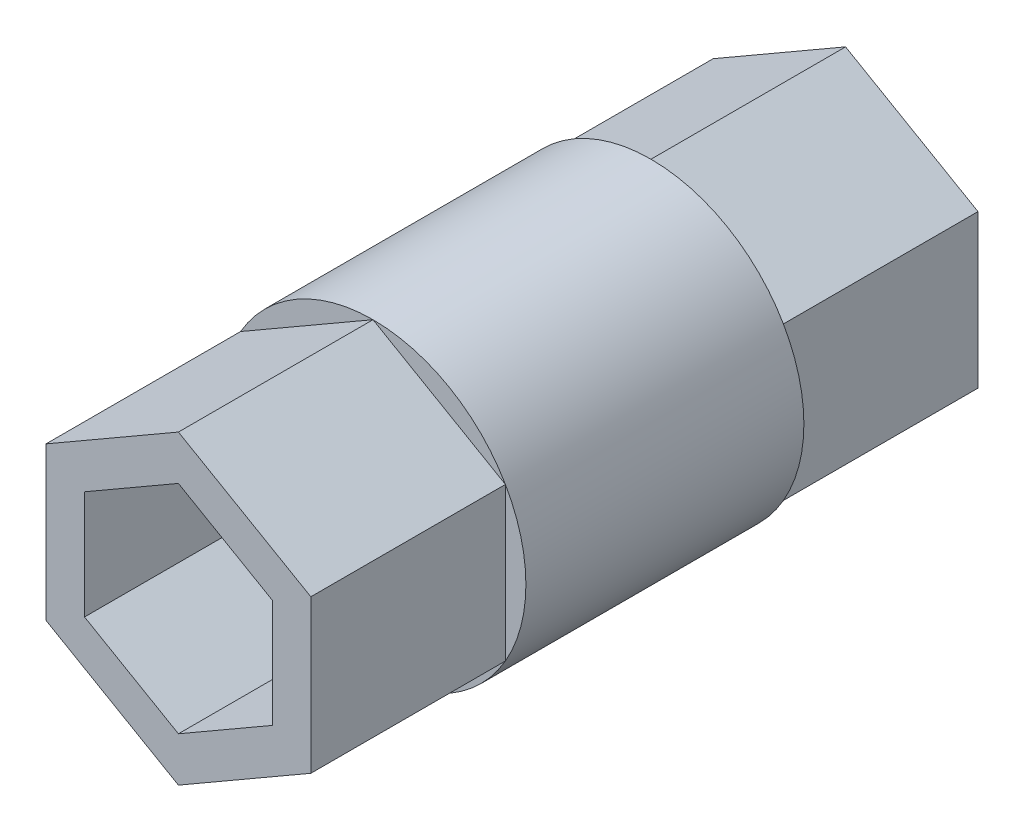
ISO-10303-21;
HEADER;
FILE_DESCRIPTION(('STEP AP214'),'2;1');
FILE_NAME('part.step','',(''),(''),'','','');
FILE_SCHEMA(('AUTOMOTIVE_DESIGN { 1 0 10303 214 1 1 1 1 }'));
ENDSEC;
DATA;
#1=APPLICATION_CONTEXT('core data for automotive mechanical design processes');
#2=APPLICATION_PROTOCOL_DEFINITION('international standard','automotive_design',2000,#1);
#3=PRODUCT_CONTEXT('',#1,'mechanical');
#4=PRODUCT('Part','Part','',(#3));
#5=PRODUCT_RELATED_PRODUCT_CATEGORY('part','',(#4));
#6=PRODUCT_DEFINITION_FORMATION('','',#4);
#7=PRODUCT_DEFINITION_CONTEXT('part definition',#1,'design');
#8=PRODUCT_DEFINITION('design','',#6,#7);
#9=PRODUCT_DEFINITION_SHAPE('','',#8);
#10=(LENGTH_UNIT() NAMED_UNIT(*) SI_UNIT(.MILLI.,.METRE.));
#11=(NAMED_UNIT(*) PLANE_ANGLE_UNIT() SI_UNIT($,.RADIAN.));
#12=(NAMED_UNIT(*) SI_UNIT($,.STERADIAN.) SOLID_ANGLE_UNIT());
#13=UNCERTAINTY_MEASURE_WITH_UNIT(LENGTH_MEASURE(1.E-05),#10,'distance_accuracy_value','');
#14=(GEOMETRIC_REPRESENTATION_CONTEXT(3) GLOBAL_UNCERTAINTY_ASSIGNED_CONTEXT((#13)) GLOBAL_UNIT_ASSIGNED_CONTEXT((#10,
#11,#12)) REPRESENTATION_CONTEXT('',''));
#15=CARTESIAN_POINT('',(0.,0.,0.));
#16=DIRECTION('',(0.,0.,1.));
#17=DIRECTION('',(1.,0.,0.));
#18=AXIS2_PLACEMENT_3D('',#15,#16,#17);
#19=CARTESIAN_POINT('',(0.,0.,10.));
#20=DIRECTION('',(0.,0.,1.));
#21=DIRECTION('',(1.,0.,0.));
#22=AXIS2_PLACEMENT_3D('',#19,#20,#21);
#23=PLANE('',#22);
#24=CARTESIAN_POINT('',(0.,0.,10.));
#25=DIRECTION('',(0.,0.,1.));
#26=DIRECTION('',(1.,0.,0.));
#27=AXIS2_PLACEMENT_3D('',#24,#25,#26);
#28=CIRCLE('',#27,11.);
#29=CARTESIAN_POINT('',(-9.52627944162882,-5.5,10.));
#30=VERTEX_POINT('',#29);
#31=CARTESIAN_POINT('',(0.,-11.,10.));
#32=VERTEX_POINT('',#31);
#33=EDGE_CURVE('E410',#30,#32,#28,.T.);
#34=ORIENTED_EDGE('',*,*,#33,.T.);
#35=DIRECTION('',(-0.866025403784439,0.5,0.));
#36=VECTOR('',#35,1.);
#37=CARTESIAN_POINT('',(-4.76313972081441,-8.25,10.));
#38=LINE('',#37,#36);
#39=EDGE_CURVE('E302',#32,#30,#38,.T.);
#40=ORIENTED_EDGE('',*,*,#39,.T.);
#41=EDGE_LOOP('',(#34,#40));
#42=FACE_BOUND('',#41,.T.);
#43=ADVANCED_FACE('F56',(#42),#23,.T.);
#44=CARTESIAN_POINT('',(9.52627944162883,-5.5,10.));
#45=VERTEX_POINT('',#44);
#46=EDGE_CURVE('E411',#32,#45,#28,.T.);
#47=ORIENTED_EDGE('',*,*,#46,.T.);
#48=DIRECTION('',(-0.866025403784439,-0.5,0.));
#49=VECTOR('',#48,1.);
#50=CARTESIAN_POINT('',(4.76313972081441,-8.25,10.));
#51=LINE('',#50,#49);
#52=EDGE_CURVE('E299',#45,#32,#51,.T.);
#53=ORIENTED_EDGE('',*,*,#52,.T.);
#54=EDGE_LOOP('',(#47,#53));
#55=FACE_BOUND('',#54,.T.);
#56=ADVANCED_FACE('F386',(#55),#23,.T.);
#57=CARTESIAN_POINT('',(9.52627944162882,5.5,10.));
#58=VERTEX_POINT('',#57);
#59=EDGE_CURVE('E311',#45,#58,#28,.T.);
#60=ORIENTED_EDGE('',*,*,#59,.T.);
#61=DIRECTION('',(0.,-1.,0.));
#62=VECTOR('',#61,1.);
#63=CARTESIAN_POINT('',(9.52627944162882,0.,10.));
#64=LINE('',#63,#62);
#65=EDGE_CURVE('E296',#58,#45,#64,.T.);
#66=ORIENTED_EDGE('',*,*,#65,.T.);
#67=EDGE_LOOP('',(#60,#66));
#68=FACE_BOUND('',#67,.T.);
#69=ADVANCED_FACE('F391',(#68),#23,.T.);
#70=CARTESIAN_POINT('',(0.,11.,10.));
#71=VERTEX_POINT('',#70);
#72=EDGE_CURVE('E306',#58,#71,#28,.T.);
#73=ORIENTED_EDGE('',*,*,#72,.T.);
#74=DIRECTION('',(0.866025403784439,-0.5,0.));
#75=VECTOR('',#74,1.);
#76=CARTESIAN_POINT('',(4.76313972081441,8.25,10.));
#77=LINE('',#76,#75);
#78=EDGE_CURVE('E293',#71,#58,#77,.T.);
#79=ORIENTED_EDGE('',*,*,#78,.T.);
#80=EDGE_LOOP('',(#73,#79));
#81=FACE_BOUND('',#80,.T.);
#82=ADVANCED_FACE('F401',(#81),#23,.T.);
#83=CARTESIAN_POINT('',(-9.52627944162882,5.5,10.));
#84=VERTEX_POINT('',#83);
#85=EDGE_CURVE('E310',#71,#84,#28,.T.);
#86=ORIENTED_EDGE('',*,*,#85,.T.);
#87=DIRECTION('',(0.866025403784439,0.5,0.));
#88=VECTOR('',#87,1.);
#89=CARTESIAN_POINT('',(-4.76313972081441,8.25,10.));
#90=LINE('',#89,#88);
#91=EDGE_CURVE('E290',#84,#71,#90,.T.);
#92=ORIENTED_EDGE('',*,*,#91,.T.);
#93=EDGE_LOOP('',(#86,#92));
#94=FACE_BOUND('',#93,.T.);
#95=ADVANCED_FACE('F396',(#94),#23,.T.);
#96=EDGE_CURVE('E405',#84,#30,#28,.T.);
#97=ORIENTED_EDGE('',*,*,#96,.T.);
#98=DIRECTION('',(0.,1.,0.));
#99=VECTOR('',#98,1.);
#100=CARTESIAN_POINT('',(-9.52627944162882,0.,10.));
#101=LINE('',#100,#99);
#102=EDGE_CURVE('E287',#30,#84,#101,.T.);
#103=ORIENTED_EDGE('',*,*,#102,.T.);
#104=EDGE_LOOP('',(#97,#103));
#105=FACE_BOUND('',#104,.T.);
#106=ADVANCED_FACE('F383',(#105),#23,.T.);
#107=CARTESIAN_POINT('',(0.,0.,-10.));
#108=DIRECTION('',(0.,0.,1.));
#109=DIRECTION('',(1.,0.,0.));
#110=AXIS2_PLACEMENT_3D('',#107,#108,#109);
#111=PLANE('',#110);
#112=DIRECTION('',(-0.866025403784439,0.5,0.));
#113=VECTOR('',#112,1.);
#114=CARTESIAN_POINT('',(-4.76313972081441,-8.25,-10.));
#115=LINE('',#114,#113);
#116=CARTESIAN_POINT('',(0.,-11.,-10.));
#117=VERTEX_POINT('',#116);
#118=CARTESIAN_POINT('',(-9.52627944162882,-5.50000000000001,-10.));
#119=VERTEX_POINT('',#118);
#120=EDGE_CURVE('E12',#117,#119,#115,.T.);
#121=ORIENTED_EDGE('',*,*,#120,.F.);
#122=CARTESIAN_POINT('',(0.,0.,-10.));
#123=DIRECTION('',(0.,0.,1.));
#124=DIRECTION('',(1.,0.,0.));
#125=AXIS2_PLACEMENT_3D('',#122,#123,#124);
#126=CIRCLE('',#125,11.);
#127=EDGE_CURVE('E375',#119,#117,#126,.T.);
#128=ORIENTED_EDGE('',*,*,#127,.F.);
#129=EDGE_LOOP('',(#121,#128));
#130=FACE_BOUND('',#129,.T.);
#131=ADVANCED_FACE('F376',(#130),#111,.F.);
#132=DIRECTION('',(-0.866025403784439,-0.5,0.));
#133=VECTOR('',#132,1.);
#134=CARTESIAN_POINT('',(4.76313972081441,-8.25,-10.));
#135=LINE('',#134,#133);
#136=CARTESIAN_POINT('',(9.52627944162883,-5.5,-10.));
#137=VERTEX_POINT('',#136);
#138=EDGE_CURVE('E64',#137,#117,#135,.T.);
#139=ORIENTED_EDGE('',*,*,#138,.F.);
#140=EDGE_CURVE('E353',#117,#137,#126,.T.);
#141=ORIENTED_EDGE('',*,*,#140,.F.);
#142=EDGE_LOOP('',(#139,#141));
#143=FACE_BOUND('',#142,.T.);
#144=ADVANCED_FACE('F377',(#143),#111,.F.);
#145=DIRECTION('',(0.,-1.,0.));
#146=VECTOR('',#145,1.);
#147=CARTESIAN_POINT('',(9.52627944162882,0.,-10.));
#148=LINE('',#147,#146);
#149=CARTESIAN_POINT('',(9.52627944162882,5.50000000000001,-10.));
#150=VERTEX_POINT('',#149);
#151=EDGE_CURVE('E324',#150,#137,#148,.T.);
#152=ORIENTED_EDGE('',*,*,#151,.F.);
#153=EDGE_CURVE('E305',#137,#150,#126,.T.);
#154=ORIENTED_EDGE('',*,*,#153,.F.);
#155=EDGE_LOOP('',(#152,#154));
#156=FACE_BOUND('',#155,.T.);
#157=ADVANCED_FACE('F348',(#156),#111,.F.);
#158=DIRECTION('',(0.866025403784439,-0.5,0.));
#159=VECTOR('',#158,1.);
#160=CARTESIAN_POINT('',(4.76313972081441,8.25,-10.));
#161=LINE('',#160,#159);
#162=CARTESIAN_POINT('',(0.,11.,-10.));
#163=VERTEX_POINT('',#162);
#164=EDGE_CURVE('E321',#163,#150,#161,.T.);
#165=ORIENTED_EDGE('',*,*,#164,.F.);
#166=EDGE_CURVE('E312',#150,#163,#126,.T.);
#167=ORIENTED_EDGE('',*,*,#166,.F.);
#168=EDGE_LOOP('',(#165,#167));
#169=FACE_BOUND('',#168,.T.);
#170=ADVANCED_FACE('F355',(#169),#111,.F.);
#171=DIRECTION('',(0.866025403784439,0.5,0.));
#172=VECTOR('',#171,1.);
#173=CARTESIAN_POINT('',(-4.76313972081441,8.25,-10.));
#174=LINE('',#173,#172);
#175=CARTESIAN_POINT('',(-9.52627944162882,5.5,-10.));
#176=VERTEX_POINT('',#175);
#177=EDGE_CURVE('E318',#176,#163,#174,.T.);
#178=ORIENTED_EDGE('',*,*,#177,.F.);
#179=EDGE_CURVE('E315',#163,#176,#126,.T.);
#180=ORIENTED_EDGE('',*,*,#179,.F.);
#181=EDGE_LOOP('',(#178,#180));
#182=FACE_BOUND('',#181,.T.);
#183=ADVANCED_FACE('F365',(#182),#111,.F.);
#184=DIRECTION('',(0.,1.,0.));
#185=VECTOR('',#184,1.);
#186=CARTESIAN_POINT('',(-9.52627944162882,0.,-10.));
#187=LINE('',#186,#185);
#188=EDGE_CURVE('E309',#119,#176,#187,.T.);
#189=ORIENTED_EDGE('',*,*,#188,.F.);
#190=EDGE_CURVE('E373',#176,#119,#126,.T.);
#191=ORIENTED_EDGE('',*,*,#190,.F.);
#192=EDGE_LOOP('',(#189,#191));
#193=FACE_BOUND('',#192,.T.);
#194=ADVANCED_FACE('F371',(#193),#111,.F.);
#195=CARTESIAN_POINT('',(0.,0.,10.));
#196=DIRECTION('',(0.,0.,-1.));
#197=DIRECTION('',(-1.,0.,0.));
#198=AXIS2_PLACEMENT_3D('',#195,#196,#197);
#199=CYLINDRICAL_SURFACE('',#198,11.);
#200=ORIENTED_EDGE('',*,*,#46,.F.);
#201=ORIENTED_EDGE('',*,*,#33,.F.);
#202=ORIENTED_EDGE('',*,*,#96,.F.);
#203=ORIENTED_EDGE('',*,*,#85,.F.);
#204=ORIENTED_EDGE('',*,*,#72,.F.);
#205=ORIENTED_EDGE('',*,*,#59,.F.);
#206=EDGE_LOOP('',(#200,#201,#202,#203,#204,#205));
#207=FACE_BOUND('',#206,.T.);
#208=ORIENTED_EDGE('',*,*,#127,.T.);
#209=ORIENTED_EDGE('',*,*,#140,.T.);
#210=ORIENTED_EDGE('',*,*,#153,.T.);
#211=ORIENTED_EDGE('',*,*,#166,.T.);
#212=ORIENTED_EDGE('',*,*,#179,.T.);
#213=ORIENTED_EDGE('',*,*,#190,.T.);
#214=EDGE_LOOP('',(#208,#209,#210,#211,#212,#213));
#215=FACE_BOUND('',#214,.T.);
#216=ADVANCED_FACE('F58',(#207,#215),#199,.T.);
#217=CARTESIAN_POINT('',(0.,0.,-24.));
#218=DIRECTION('',(0.,0.,1.));
#219=DIRECTION('',(1.,0.,0.));
#220=AXIS2_PLACEMENT_3D('',#217,#218,#219);
#221=PLANE('',#220);
#222=DIRECTION('',(0.,-1.,0.));
#223=VECTOR('',#222,1.);
#224=CARTESIAN_POINT('',(-6.75499814951862,3.9,-24.));
#225=LINE('',#224,#223);
#226=CARTESIAN_POINT('',(-6.75499814951862,3.9,-24.));
#227=VERTEX_POINT('',#226);
#228=CARTESIAN_POINT('',(-6.75499814951862,-3.9,-24.));
#229=VERTEX_POINT('',#228);
#230=EDGE_CURVE('E189',#227,#229,#225,.T.);
#231=ORIENTED_EDGE('',*,*,#230,.T.);
#232=DIRECTION('',(0.866025403784439,-0.5,0.));
#233=VECTOR('',#232,1.);
#234=CARTESIAN_POINT('',(-6.75499814951862,-3.9,-24.));
#235=LINE('',#234,#233);
#236=CARTESIAN_POINT('',(0.,-7.8,-24.));
#237=VERTEX_POINT('',#236);
#238=EDGE_CURVE('E183',#229,#237,#235,.T.);
#239=ORIENTED_EDGE('',*,*,#238,.T.);
#240=DIRECTION('',(0.866025403784439,0.5,0.));
#241=VECTOR('',#240,1.);
#242=CARTESIAN_POINT('',(0.,-7.8,-24.));
#243=LINE('',#242,#241);
#244=CARTESIAN_POINT('',(6.75499814951862,-3.9,-24.));
#245=VERTEX_POINT('',#244);
#246=EDGE_CURVE('E192',#237,#245,#243,.T.);
#247=ORIENTED_EDGE('',*,*,#246,.T.);
#248=DIRECTION('',(0.,1.,0.));
#249=VECTOR('',#248,1.);
#250=CARTESIAN_POINT('',(6.75499814951862,-3.9,-24.));
#251=LINE('',#250,#249);
#252=CARTESIAN_POINT('',(6.75499814951862,3.9,-24.));
#253=VERTEX_POINT('',#252);
#254=EDGE_CURVE('E71',#245,#253,#251,.T.);
#255=ORIENTED_EDGE('',*,*,#254,.T.);
#256=DIRECTION('',(-0.866025403784439,0.5,0.));
#257=VECTOR('',#256,1.);
#258=CARTESIAN_POINT('',(6.75499814951862,3.9,-24.));
#259=LINE('',#258,#257);
#260=CARTESIAN_POINT('',(0.,7.8,-24.));
#261=VERTEX_POINT('',#260);
#262=EDGE_CURVE('E207',#253,#261,#259,.T.);
#263=ORIENTED_EDGE('',*,*,#262,.T.);
#264=DIRECTION('',(-0.866025403784439,-0.5,0.));
#265=VECTOR('',#264,1.);
#266=CARTESIAN_POINT('',(0.,7.8,-24.));
#267=LINE('',#266,#265);
#268=EDGE_CURVE('E210',#261,#227,#267,.T.);
#269=ORIENTED_EDGE('',*,*,#268,.T.);
#270=EDGE_LOOP('',(#231,#239,#247,#255,#263,#269));
#271=FACE_BOUND('',#270,.T.);
#272=DIRECTION('',(0.,-1.,0.));
#273=VECTOR('',#272,1.);
#274=CARTESIAN_POINT('',(-9.52627944162882,0.,-24.));
#275=LINE('',#274,#273);
#276=CARTESIAN_POINT('',(-9.52627944162882,5.5,-24.));
#277=VERTEX_POINT('',#276);
#278=CARTESIAN_POINT('',(-9.52627944162882,-5.5,-24.));
#279=VERTEX_POINT('',#278);
#280=EDGE_CURVE('E226',#277,#279,#275,.T.);
#281=ORIENTED_EDGE('',*,*,#280,.F.);
#282=DIRECTION('',(-0.866025403784439,-0.5,0.));
#283=VECTOR('',#282,1.);
#284=CARTESIAN_POINT('',(-4.76313972081441,8.25,-24.));
#285=LINE('',#284,#283);
#286=CARTESIAN_POINT('',(0.,11.,-24.));
#287=VERTEX_POINT('',#286);
#288=EDGE_CURVE('E238',#287,#277,#285,.T.);
#289=ORIENTED_EDGE('',*,*,#288,.F.);
#290=DIRECTION('',(-0.866025403784439,0.5,0.));
#291=VECTOR('',#290,1.);
#292=CARTESIAN_POINT('',(4.76313972081441,8.25,-24.));
#293=LINE('',#292,#291);
#294=CARTESIAN_POINT('',(9.52627944162882,5.5,-24.));
#295=VERTEX_POINT('',#294);
#296=EDGE_CURVE('E260',#295,#287,#293,.T.);
#297=ORIENTED_EDGE('',*,*,#296,.F.);
#298=DIRECTION('',(0.,1.,0.));
#299=VECTOR('',#298,1.);
#300=CARTESIAN_POINT('',(9.52627944162882,0.,-24.));
#301=LINE('',#300,#299);
#302=CARTESIAN_POINT('',(9.52627944162883,-5.5,-24.));
#303=VERTEX_POINT('',#302);
#304=EDGE_CURVE('E257',#303,#295,#301,.T.);
#305=ORIENTED_EDGE('',*,*,#304,.F.);
#306=DIRECTION('',(0.866025403784439,0.5,0.));
#307=VECTOR('',#306,1.);
#308=CARTESIAN_POINT('',(4.76313972081441,-8.25,-24.));
#309=LINE('',#308,#307);
#310=CARTESIAN_POINT('',(0.,-11.,-24.));
#311=VERTEX_POINT('',#310);
#312=EDGE_CURVE('E254',#311,#303,#309,.T.);
#313=ORIENTED_EDGE('',*,*,#312,.F.);
#314=DIRECTION('',(0.866025403784439,-0.5,0.));
#315=VECTOR('',#314,1.);
#316=CARTESIAN_POINT('',(-4.76313972081441,-8.25,-24.));
#317=LINE('',#316,#315);
#318=EDGE_CURVE('E251',#279,#311,#317,.T.);
#319=ORIENTED_EDGE('',*,*,#318,.F.);
#320=EDGE_LOOP('',(#281,#289,#297,#305,#313,#319));
#321=FACE_BOUND('',#320,.T.);
#322=ADVANCED_FACE('F196',(#271,#321),#221,.F.);
#323=CARTESIAN_POINT('',(-9.52627944162882,0.,24.));
#324=DIRECTION('',(1.,0.,0.));
#325=DIRECTION('',(0.,1.,0.));
#326=AXIS2_PLACEMENT_3D('',#323,#324,#325);
#327=PLANE('',#326);
#328=DIRECTION('',(0.,0.,-1.));
#329=VECTOR('',#328,1.);
#330=CARTESIAN_POINT('',(-9.52627944162882,-5.5,24.));
#331=LINE('',#330,#329);
#332=EDGE_CURVE('E283',#119,#279,#331,.T.);
#333=ORIENTED_EDGE('',*,*,#332,.F.);
#334=ORIENTED_EDGE('',*,*,#188,.T.);
#335=DIRECTION('',(0.,0.,-1.));
#336=VECTOR('',#335,1.);
#337=CARTESIAN_POINT('',(-9.52627944162882,5.5,24.));
#338=LINE('',#337,#336);
#339=EDGE_CURVE('E248',#176,#277,#338,.T.);
#340=ORIENTED_EDGE('',*,*,#339,.T.);
#341=ORIENTED_EDGE('',*,*,#280,.T.);
#342=EDGE_LOOP('',(#333,#334,#340,#341));
#343=FACE_BOUND('',#342,.T.);
#344=ADVANCED_FACE('F367',(#343),#327,.F.);
#345=CARTESIAN_POINT('',(-4.76313972081441,8.25,24.));
#346=DIRECTION('',(0.5,-0.866025403784439,0.));
#347=DIRECTION('',(0.866025403784439,0.5,0.));
#348=AXIS2_PLACEMENT_3D('',#345,#346,#347);
#349=PLANE('',#348);
#350=ORIENTED_EDGE('',*,*,#339,.F.);
#351=ORIENTED_EDGE('',*,*,#177,.T.);
#352=DIRECTION('',(0.,0.,-1.));
#353=VECTOR('',#352,1.);
#354=CARTESIAN_POINT('',(0.,11.,24.));
#355=LINE('',#354,#353);
#356=EDGE_CURVE('E267',#163,#287,#355,.T.);
#357=ORIENTED_EDGE('',*,*,#356,.T.);
#358=ORIENTED_EDGE('',*,*,#288,.T.);
#359=EDGE_LOOP('',(#350,#351,#357,#358));
#360=FACE_BOUND('',#359,.T.);
#361=ADVANCED_FACE('F362',(#360),#349,.F.);
#362=CARTESIAN_POINT('',(4.76313972081441,8.25,24.));
#363=DIRECTION('',(-0.5,-0.866025403784439,0.));
#364=DIRECTION('',(0.866025403784439,-0.5,0.));
#365=AXIS2_PLACEMENT_3D('',#362,#363,#364);
#366=PLANE('',#365);
#367=ORIENTED_EDGE('',*,*,#356,.F.);
#368=ORIENTED_EDGE('',*,*,#164,.T.);
#369=DIRECTION('',(0.,0.,-1.));
#370=VECTOR('',#369,1.);
#371=CARTESIAN_POINT('',(9.52627944162882,5.5,24.));
#372=LINE('',#371,#370);
#373=EDGE_CURVE('E271',#150,#295,#372,.T.);
#374=ORIENTED_EDGE('',*,*,#373,.T.);
#375=ORIENTED_EDGE('',*,*,#296,.T.);
#376=EDGE_LOOP('',(#367,#368,#374,#375));
#377=FACE_BOUND('',#376,.T.);
#378=ADVANCED_FACE('F359',(#377),#366,.F.);
#379=CARTESIAN_POINT('',(9.52627944162882,0.,24.));
#380=DIRECTION('',(-1.,0.,0.));
#381=DIRECTION('',(0.,-1.,0.));
#382=AXIS2_PLACEMENT_3D('',#379,#380,#381);
#383=PLANE('',#382);
#384=ORIENTED_EDGE('',*,*,#373,.F.);
#385=ORIENTED_EDGE('',*,*,#151,.T.);
#386=DIRECTION('',(0.,0.,-1.));
#387=VECTOR('',#386,1.);
#388=CARTESIAN_POINT('',(9.52627944162883,-5.5,24.));
#389=LINE('',#388,#387);
#390=EDGE_CURVE('E275',#137,#303,#389,.T.);
#391=ORIENTED_EDGE('',*,*,#390,.T.);
#392=ORIENTED_EDGE('',*,*,#304,.T.);
#393=EDGE_LOOP('',(#384,#385,#391,#392));
#394=FACE_BOUND('',#393,.T.);
#395=ADVANCED_FACE('F345',(#394),#383,.F.);
#396=CARTESIAN_POINT('',(4.76313972081441,-8.25,24.));
#397=DIRECTION('',(-0.5,0.866025403784439,0.));
#398=DIRECTION('',(-0.866025403784439,-0.5,0.));
#399=AXIS2_PLACEMENT_3D('',#396,#397,#398);
#400=PLANE('',#399);
#401=ORIENTED_EDGE('',*,*,#390,.F.);
#402=ORIENTED_EDGE('',*,*,#138,.T.);
#403=DIRECTION('',(0.,0.,-1.));
#404=VECTOR('',#403,1.);
#405=CARTESIAN_POINT('',(0.,-11.,24.));
#406=LINE('',#405,#404);
#407=EDGE_CURVE('E279',#117,#311,#406,.T.);
#408=ORIENTED_EDGE('',*,*,#407,.T.);
#409=ORIENTED_EDGE('',*,*,#312,.T.);
#410=EDGE_LOOP('',(#401,#402,#408,#409));
#411=FACE_BOUND('',#410,.T.);
#412=ADVANCED_FACE('F330',(#411),#400,.F.);
#413=CARTESIAN_POINT('',(-4.76313972081441,-8.25,24.));
#414=DIRECTION('',(0.5,0.866025403784439,0.));
#415=DIRECTION('',(-0.866025403784439,0.5,0.));
#416=AXIS2_PLACEMENT_3D('',#413,#414,#415);
#417=PLANE('',#416);
#418=ORIENTED_EDGE('',*,*,#407,.F.);
#419=ORIENTED_EDGE('',*,*,#120,.T.);
#420=ORIENTED_EDGE('',*,*,#332,.T.);
#421=ORIENTED_EDGE('',*,*,#318,.T.);
#422=EDGE_LOOP('',(#418,#419,#420,#421));
#423=FACE_BOUND('',#422,.T.);
#424=ADVANCED_FACE('F335',(#423),#417,.F.);
#425=ORIENTED_EDGE('',*,*,#39,.F.);
#426=CARTESIAN_POINT('',(0.,-11.,24.));
#427=VERTEX_POINT('',#426);
#428=EDGE_CURVE('E280',#427,#32,#406,.T.);
#429=ORIENTED_EDGE('',*,*,#428,.F.);
#430=DIRECTION('',(0.866025403784439,-0.5,0.));
#431=VECTOR('',#430,1.);
#432=CARTESIAN_POINT('',(-4.76313972081441,-8.25,24.));
#433=LINE('',#432,#431);
#434=CARTESIAN_POINT('',(-9.52627944162882,-5.5,24.));
#435=VERTEX_POINT('',#434);
#436=EDGE_CURVE('E237',#435,#427,#433,.T.);
#437=ORIENTED_EDGE('',*,*,#436,.F.);
#438=EDGE_CURVE('E284',#435,#30,#331,.T.);
#439=ORIENTED_EDGE('',*,*,#438,.T.);
#440=EDGE_LOOP('',(#425,#429,#437,#439));
#441=FACE_BOUND('',#440,.T.);
#442=ADVANCED_FACE('F442',(#441),#417,.F.);
#443=ORIENTED_EDGE('',*,*,#52,.F.);
#444=CARTESIAN_POINT('',(9.52627944162883,-5.5,24.));
#445=VERTEX_POINT('',#444);
#446=EDGE_CURVE('E276',#445,#45,#389,.T.);
#447=ORIENTED_EDGE('',*,*,#446,.F.);
#448=DIRECTION('',(0.866025403784439,0.5,0.));
#449=VECTOR('',#448,1.);
#450=CARTESIAN_POINT('',(4.76313972081441,-8.25,24.));
#451=LINE('',#450,#449);
#452=EDGE_CURVE('E240',#427,#445,#451,.T.);
#453=ORIENTED_EDGE('',*,*,#452,.F.);
#454=ORIENTED_EDGE('',*,*,#428,.T.);
#455=EDGE_LOOP('',(#443,#447,#453,#454));
#456=FACE_BOUND('',#455,.T.);
#457=ADVANCED_FACE('F439',(#456),#400,.F.);
#458=ORIENTED_EDGE('',*,*,#65,.F.);
#459=CARTESIAN_POINT('',(9.52627944162882,5.5,24.));
#460=VERTEX_POINT('',#459);
#461=EDGE_CURVE('E272',#460,#58,#372,.T.);
#462=ORIENTED_EDGE('',*,*,#461,.F.);
#463=DIRECTION('',(0.,1.,0.));
#464=VECTOR('',#463,1.);
#465=CARTESIAN_POINT('',(9.52627944162882,0.,24.));
#466=LINE('',#465,#464);
#467=EDGE_CURVE('E242',#445,#460,#466,.T.);
#468=ORIENTED_EDGE('',*,*,#467,.F.);
#469=ORIENTED_EDGE('',*,*,#446,.T.);
#470=EDGE_LOOP('',(#458,#462,#468,#469));
#471=FACE_BOUND('',#470,.T.);
#472=ADVANCED_FACE('F437',(#471),#383,.F.);
#473=ORIENTED_EDGE('',*,*,#78,.F.);
#474=CARTESIAN_POINT('',(0.,11.,24.));
#475=VERTEX_POINT('',#474);
#476=EDGE_CURVE('E268',#475,#71,#355,.T.);
#477=ORIENTED_EDGE('',*,*,#476,.F.);
#478=DIRECTION('',(-0.866025403784439,0.5,0.));
#479=VECTOR('',#478,1.);
#480=CARTESIAN_POINT('',(4.76313972081441,8.25,24.));
#481=LINE('',#480,#479);
#482=EDGE_CURVE('E244',#460,#475,#481,.T.);
#483=ORIENTED_EDGE('',*,*,#482,.F.);
#484=ORIENTED_EDGE('',*,*,#461,.T.);
#485=EDGE_LOOP('',(#473,#477,#483,#484));
#486=FACE_BOUND('',#485,.T.);
#487=ADVANCED_FACE('F421',(#486),#366,.F.);
#488=ORIENTED_EDGE('',*,*,#91,.F.);
#489=CARTESIAN_POINT('',(-9.52627944162882,5.5,24.));
#490=VERTEX_POINT('',#489);
#491=EDGE_CURVE('E265',#490,#84,#338,.T.);
#492=ORIENTED_EDGE('',*,*,#491,.F.);
#493=DIRECTION('',(-0.866025403784439,-0.5,0.));
#494=VECTOR('',#493,1.);
#495=CARTESIAN_POINT('',(-4.76313972081441,8.25,24.));
#496=LINE('',#495,#494);
#497=EDGE_CURVE('E246',#475,#490,#496,.T.);
#498=ORIENTED_EDGE('',*,*,#497,.F.);
#499=ORIENTED_EDGE('',*,*,#476,.T.);
#500=EDGE_LOOP('',(#488,#492,#498,#499));
#501=FACE_BOUND('',#500,.T.);
#502=ADVANCED_FACE('F427',(#501),#349,.F.);
#503=ORIENTED_EDGE('',*,*,#102,.F.);
#504=ORIENTED_EDGE('',*,*,#438,.F.);
#505=DIRECTION('',(0.,-1.,0.));
#506=VECTOR('',#505,1.);
#507=CARTESIAN_POINT('',(-9.52627944162882,0.,24.));
#508=LINE('',#507,#506);
#509=EDGE_CURVE('E234',#490,#435,#508,.T.);
#510=ORIENTED_EDGE('',*,*,#509,.F.);
#511=ORIENTED_EDGE('',*,*,#491,.T.);
#512=EDGE_LOOP('',(#503,#504,#510,#511));
#513=FACE_BOUND('',#512,.T.);
#514=ADVANCED_FACE('F444',(#513),#327,.F.);
#515=CARTESIAN_POINT('',(0.,0.,24.));
#516=DIRECTION('',(0.,0.,1.));
#517=DIRECTION('',(1.,0.,0.));
#518=AXIS2_PLACEMENT_3D('',#515,#516,#517);
#519=PLANE('',#518);
#520=DIRECTION('',(0.866025403784439,-0.5,0.));
#521=VECTOR('',#520,1.);
#522=CARTESIAN_POINT('',(-6.75499814951862,-3.9,24.));
#523=LINE('',#522,#521);
#524=CARTESIAN_POINT('',(-6.75499814951862,-3.9,24.));
#525=VERTEX_POINT('',#524);
#526=CARTESIAN_POINT('',(0.,-7.8,24.));
#527=VERTEX_POINT('',#526);
#528=EDGE_CURVE('E79',#525,#527,#523,.T.);
#529=ORIENTED_EDGE('',*,*,#528,.F.);
#530=DIRECTION('',(0.,-1.,0.));
#531=VECTOR('',#530,1.);
#532=CARTESIAN_POINT('',(-6.75499814951862,3.9,24.));
#533=LINE('',#532,#531);
#534=CARTESIAN_POINT('',(-6.75499814951862,3.9,24.));
#535=VERTEX_POINT('',#534);
#536=EDGE_CURVE('E200',#535,#525,#533,.T.);
#537=ORIENTED_EDGE('',*,*,#536,.F.);
#538=DIRECTION('',(-0.866025403784439,-0.5,0.));
#539=VECTOR('',#538,1.);
#540=CARTESIAN_POINT('',(0.,7.8,24.));
#541=LINE('',#540,#539);
#542=CARTESIAN_POINT('',(0.,7.8,24.));
#543=VERTEX_POINT('',#542);
#544=EDGE_CURVE('E203',#543,#535,#541,.T.);
#545=ORIENTED_EDGE('',*,*,#544,.F.);
#546=DIRECTION('',(-0.866025403784439,0.5,0.));
#547=VECTOR('',#546,1.);
#548=CARTESIAN_POINT('',(6.75499814951862,3.9,24.));
#549=LINE('',#548,#547);
#550=CARTESIAN_POINT('',(6.75499814951862,3.9,24.));
#551=VERTEX_POINT('',#550);
#552=EDGE_CURVE('E219',#551,#543,#549,.T.);
#553=ORIENTED_EDGE('',*,*,#552,.F.);
#554=DIRECTION('',(0.,1.,0.));
#555=VECTOR('',#554,1.);
#556=CARTESIAN_POINT('',(6.75499814951862,-3.9,24.));
#557=LINE('',#556,#555);
#558=CARTESIAN_POINT('',(6.75499814951862,-3.9,24.));
#559=VERTEX_POINT('',#558);
#560=EDGE_CURVE('E216',#559,#551,#557,.T.);
#561=ORIENTED_EDGE('',*,*,#560,.F.);
#562=DIRECTION('',(0.866025403784439,0.5,0.));
#563=VECTOR('',#562,1.);
#564=CARTESIAN_POINT('',(0.,-7.8,24.));
#565=LINE('',#564,#563);
#566=EDGE_CURVE('E214',#527,#559,#565,.T.);
#567=ORIENTED_EDGE('',*,*,#566,.F.);
#568=EDGE_LOOP('',(#529,#537,#545,#553,#561,#567));
#569=FACE_BOUND('',#568,.T.);
#570=ORIENTED_EDGE('',*,*,#509,.T.);
#571=ORIENTED_EDGE('',*,*,#436,.T.);
#572=ORIENTED_EDGE('',*,*,#452,.T.);
#573=ORIENTED_EDGE('',*,*,#467,.T.);
#574=ORIENTED_EDGE('',*,*,#482,.T.);
#575=ORIENTED_EDGE('',*,*,#497,.T.);
#576=EDGE_LOOP('',(#570,#571,#572,#573,#574,#575));
#577=FACE_BOUND('',#576,.T.);
#578=ADVANCED_FACE('F431',(#569,#577),#519,.T.);
#579=CARTESIAN_POINT('',(-6.75499814951862,-3.9,-24.));
#580=DIRECTION('',(-0.5,-0.866025403784439,0.));
#581=DIRECTION('',(0.866025403784439,-0.5,0.));
#582=AXIS2_PLACEMENT_3D('',#579,#580,#581);
#583=PLANE('',#582);
#584=ORIENTED_EDGE('',*,*,#528,.T.);
#585=DIRECTION('',(0.,0.,1.));
#586=VECTOR('',#585,1.);
#587=CARTESIAN_POINT('',(0.,-7.8,-24.));
#588=LINE('',#587,#586);
#589=EDGE_CURVE('E179',#237,#527,#588,.T.);
#590=ORIENTED_EDGE('',*,*,#589,.F.);
#591=ORIENTED_EDGE('',*,*,#238,.F.);
#592=DIRECTION('',(0.,0.,1.));
#593=VECTOR('',#592,1.);
#594=CARTESIAN_POINT('',(-6.75499814951862,-3.9,-24.));
#595=LINE('',#594,#593);
#596=EDGE_CURVE('E224',#229,#525,#595,.T.);
#597=ORIENTED_EDGE('',*,*,#596,.T.);
#598=EDGE_LOOP('',(#584,#590,#591,#597));
#599=FACE_BOUND('',#598,.T.);
#600=ADVANCED_FACE('F181',(#599),#583,.F.);
#601=CARTESIAN_POINT('',(-6.75499814951862,3.9,-24.));
#602=DIRECTION('',(-1.,0.,0.));
#603=DIRECTION('',(0.,-1.,0.));
#604=AXIS2_PLACEMENT_3D('',#601,#602,#603);
#605=PLANE('',#604);
#606=ORIENTED_EDGE('',*,*,#536,.T.);
#607=ORIENTED_EDGE('',*,*,#596,.F.);
#608=ORIENTED_EDGE('',*,*,#230,.F.);
#609=DIRECTION('',(0.,0.,1.));
#610=VECTOR('',#609,1.);
#611=CARTESIAN_POINT('',(-6.75499814951862,3.9,-24.));
#612=LINE('',#611,#610);
#613=EDGE_CURVE('E227',#227,#535,#612,.T.);
#614=ORIENTED_EDGE('',*,*,#613,.T.);
#615=EDGE_LOOP('',(#606,#607,#608,#614));
#616=FACE_BOUND('',#615,.T.);
#617=ADVANCED_FACE('F623',(#616),#605,.F.);
#618=CARTESIAN_POINT('',(0.,7.8,-24.));
#619=DIRECTION('',(-0.5,0.866025403784438,0.));
#620=DIRECTION('',(-0.866025403784439,-0.5,0.));
#621=AXIS2_PLACEMENT_3D('',#618,#619,#620);
#622=PLANE('',#621);
#623=ORIENTED_EDGE('',*,*,#544,.T.);
#624=ORIENTED_EDGE('',*,*,#613,.F.);
#625=ORIENTED_EDGE('',*,*,#268,.F.);
#626=DIRECTION('',(0.,0.,1.));
#627=VECTOR('',#626,1.);
#628=CARTESIAN_POINT('',(0.,7.8,-24.));
#629=LINE('',#628,#627);
#630=EDGE_CURVE('E229',#261,#543,#629,.T.);
#631=ORIENTED_EDGE('',*,*,#630,.T.);
#632=EDGE_LOOP('',(#623,#624,#625,#631));
#633=FACE_BOUND('',#632,.T.);
#634=ADVANCED_FACE('F631',(#633),#622,.F.);
#635=CARTESIAN_POINT('',(6.75499814951862,3.9,-24.));
#636=DIRECTION('',(0.5,0.866025403784439,0.));
#637=DIRECTION('',(-0.866025403784439,0.5,0.));
#638=AXIS2_PLACEMENT_3D('',#635,#636,#637);
#639=PLANE('',#638);
#640=ORIENTED_EDGE('',*,*,#552,.T.);
#641=ORIENTED_EDGE('',*,*,#630,.F.);
#642=ORIENTED_EDGE('',*,*,#262,.F.);
#643=DIRECTION('',(0.,0.,1.));
#644=VECTOR('',#643,1.);
#645=CARTESIAN_POINT('',(6.75499814951862,3.9,-24.));
#646=LINE('',#645,#644);
#647=EDGE_CURVE('E231',#253,#551,#646,.T.);
#648=ORIENTED_EDGE('',*,*,#647,.T.);
#649=EDGE_LOOP('',(#640,#641,#642,#648));
#650=FACE_BOUND('',#649,.T.);
#651=ADVANCED_FACE('F641',(#650),#639,.F.);
#652=CARTESIAN_POINT('',(6.75499814951862,-3.9,-24.));
#653=DIRECTION('',(1.,0.,0.));
#654=DIRECTION('',(0.,1.,0.));
#655=AXIS2_PLACEMENT_3D('',#652,#653,#654);
#656=PLANE('',#655);
#657=ORIENTED_EDGE('',*,*,#560,.T.);
#658=ORIENTED_EDGE('',*,*,#647,.F.);
#659=ORIENTED_EDGE('',*,*,#254,.F.);
#660=DIRECTION('',(0.,0.,1.));
#661=VECTOR('',#660,1.);
#662=CARTESIAN_POINT('',(6.75499814951862,-3.9,-24.));
#663=LINE('',#662,#661);
#664=EDGE_CURVE('E188',#245,#559,#663,.T.);
#665=ORIENTED_EDGE('',*,*,#664,.T.);
#666=EDGE_LOOP('',(#657,#658,#659,#665));
#667=FACE_BOUND('',#666,.T.);
#668=ADVANCED_FACE('F651',(#667),#656,.F.);
#669=CARTESIAN_POINT('',(0.,-7.8,-24.));
#670=DIRECTION('',(0.5,-0.866025403784439,0.));
#671=DIRECTION('',(0.866025403784439,0.5,0.));
#672=AXIS2_PLACEMENT_3D('',#669,#670,#671);
#673=PLANE('',#672);
#674=ORIENTED_EDGE('',*,*,#566,.T.);
#675=ORIENTED_EDGE('',*,*,#664,.F.);
#676=ORIENTED_EDGE('',*,*,#246,.F.);
#677=ORIENTED_EDGE('',*,*,#589,.T.);
#678=EDGE_LOOP('',(#674,#675,#676,#677));
#679=FACE_BOUND('',#678,.T.);
#680=ADVANCED_FACE('F193',(#679),#673,.F.);
#681=CLOSED_SHELL('',(#43,#56,#69,#82,#95,#106,#131,#144,#157,#170,#183,#194,#216,#322,#344,
#361,#378,#395,#412,#424,#442,#457,#472,#487,#502,#514,#578,#600,#617,#634,#651,#668,#680));
#682=MANIFOLD_SOLID_BREP('B2',#681);
#683=ADVANCED_BREP_SHAPE_REPRESENTATION('',(#18,#682),#14);
#684=SHAPE_DEFINITION_REPRESENTATION(#9,#683);
ENDSEC;
END-ISO-10303-21;
